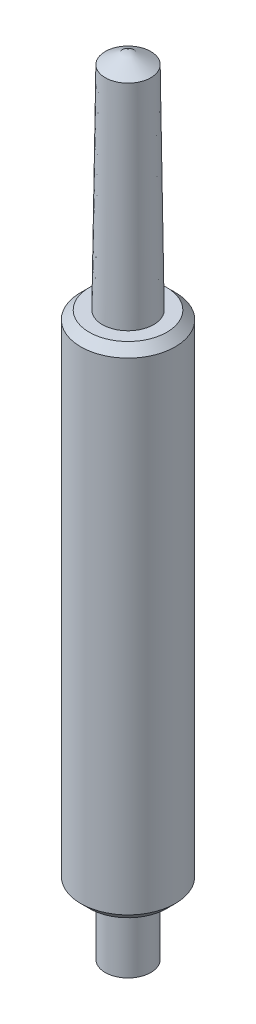
ISO-10303-21;
HEADER;
FILE_DESCRIPTION(('STEP AP214'),'2;1');
FILE_NAME('part.step','',(''),(''),'','','');
FILE_SCHEMA(('AUTOMOTIVE_DESIGN { 1 0 10303 214 1 1 1 1 }'));
ENDSEC;
DATA;
#1=APPLICATION_CONTEXT('core data for automotive mechanical design processes');
#2=APPLICATION_PROTOCOL_DEFINITION('international standard','automotive_design',2000,#1);
#3=PRODUCT_CONTEXT('',#1,'mechanical');
#4=PRODUCT('Part','Part','',(#3));
#5=PRODUCT_RELATED_PRODUCT_CATEGORY('part','',(#4));
#6=PRODUCT_DEFINITION_FORMATION('','',#4);
#7=PRODUCT_DEFINITION_CONTEXT('part definition',#1,'design');
#8=PRODUCT_DEFINITION('design','',#6,#7);
#9=PRODUCT_DEFINITION_SHAPE('','',#8);
#10=(LENGTH_UNIT() NAMED_UNIT(*) SI_UNIT(.MILLI.,.METRE.));
#11=(NAMED_UNIT(*) PLANE_ANGLE_UNIT() SI_UNIT($,.RADIAN.));
#12=(NAMED_UNIT(*) SI_UNIT($,.STERADIAN.) SOLID_ANGLE_UNIT());
#13=UNCERTAINTY_MEASURE_WITH_UNIT(LENGTH_MEASURE(1.E-05),#10,'distance_accuracy_value','');
#14=(GEOMETRIC_REPRESENTATION_CONTEXT(3) GLOBAL_UNCERTAINTY_ASSIGNED_CONTEXT((#13)) GLOBAL_UNIT_ASSIGNED_CONTEXT((#10,
#11,#12)) REPRESENTATION_CONTEXT('',''));
#15=CARTESIAN_POINT('',(0.,0.,0.));
#16=DIRECTION('',(0.,0.,1.));
#17=DIRECTION('',(1.,0.,0.));
#18=AXIS2_PLACEMENT_3D('',#15,#16,#17);
#19=CARTESIAN_POINT('',(-3.89989382420324E-12,-1000.,0.));
#20=DIRECTION('',(0.,-1.,0.));
#21=DIRECTION('',(1.,0.,0.));
#22=AXIS2_PLACEMENT_3D('',#19,#20,#21);
#23=CYLINDRICAL_SURFACE('',#22,0.135000000000407);
#24=CARTESIAN_POINT('',(-4.08156239819756E-13,0.0733916396744583,0.));
#25=DIRECTION('',(0.,-1.,0.));
#26=DIRECTION('',(1.,0.,0.));
#27=AXIS2_PLACEMENT_3D('',#24,#25,#26);
#28=CIRCLE('',#27,0.135000000000408);
#29=CARTESIAN_POINT('',(0.135,0.0733916396744578,0.));
#30=VERTEX_POINT('',#29);
#31=EDGE_CURVE('E11',#30,#30,#28,.T.);
#32=ORIENTED_EDGE('',*,*,#31,.F.);
#33=EDGE_LOOP('',(#32));
#34=FACE_BOUND('',#33,.T.);
#35=CARTESIAN_POINT('',(-4.06841318757627E-13,0.450000000000061,0.));
#36=DIRECTION('',(0.,-1.,0.));
#37=DIRECTION('',(1.,0.,0.));
#38=AXIS2_PLACEMENT_3D('',#35,#36,#37);
#39=CIRCLE('',#38,0.135000000000407);
#40=CARTESIAN_POINT('',(0.135,0.450000000000061,0.));
#41=VERTEX_POINT('',#40);
#42=EDGE_CURVE('E55',#41,#41,#39,.T.);
#43=ORIENTED_EDGE('',*,*,#42,.T.);
#44=EDGE_LOOP('',(#43));
#45=FACE_BOUND('',#44,.T.);
#46=ADVANCED_FACE('F32',(#34,#45),#23,.T.);
#47=CARTESIAN_POINT('',(-4.08156239819756E-13,0.0733916396744583,0.));
#48=DIRECTION('',(0.,1.,0.));
#49=DIRECTION('',(-1.,0.,0.));
#50=AXIS2_PLACEMENT_3D('',#47,#48,#49);
#51=CONICAL_SURFACE('',#50,0.135000000000408,1.07284777274958);
#52=CARTESIAN_POINT('',(-4.08412485360107E-13,0.,0.));
#53=VERTEX_POINT('',#52);
#54=VERTEX_LOOP('',#53);
#55=FACE_BOUND('',#54,.T.);
#56=ORIENTED_EDGE('',*,*,#31,.T.);
#57=EDGE_LOOP('',(#56));
#58=FACE_BOUND('',#57,.T.);
#59=ADVANCED_FACE('F45',(#55,#58),#51,.T.);
#60=CARTESIAN_POINT('',(-3.91827949000599E-13,4.7500000000007,0.));
#61=DIRECTION('',(0.,-1.,0.));
#62=DIRECTION('',(1.,0.,0.));
#63=AXIS2_PLACEMENT_3D('',#60,#61,#62);
#64=CONICAL_SURFACE('',#63,1.96535075528762E-13,1.0358412530179);
#65=CARTESIAN_POINT('',(-3.92107267507701E-13,4.67000000000217,0.));
#66=DIRECTION('',(0.,-1.,0.));
#67=DIRECTION('',(1.,0.,0.));
#68=AXIS2_PLACEMENT_3D('',#65,#66,#67);
#69=CIRCLE('',#68,0.135000000000509);
#70=CARTESIAN_POINT('',(0.135000000000117,4.67000000000217,0.));
#71=VERTEX_POINT('',#70);
#72=EDGE_CURVE('E39',#71,#71,#69,.T.);
#73=ORIENTED_EDGE('',*,*,#72,.F.);
#74=EDGE_LOOP('',(#73));
#75=FACE_BOUND('',#74,.T.);
#76=CARTESIAN_POINT('',(-1.95913974500285E-13,4.75000000000068,0.));
#77=VERTEX_POINT('',#76);
#78=VERTEX_LOOP('',#77);
#79=FACE_BOUND('',#78,.T.);
#80=ADVANCED_FACE('F48',(#75,#79),#64,.T.);
#81=CARTESIAN_POINT('',(-3.92107267507701E-13,4.67000000000217,0.));
#82=DIRECTION('',(0.,-1.,0.));
#83=DIRECTION('',(1.,0.,0.));
#84=AXIS2_PLACEMENT_3D('',#81,#82,#83);
#85=CONICAL_SURFACE('',#84,0.135000000000509,0.0134912448961209);
#86=CARTESIAN_POINT('',(-3.96506533994647E-13,3.41000000000125,0.));
#87=DIRECTION('',(0.,-1.,0.));
#88=DIRECTION('',(1.,0.,0.));
#89=AXIS2_PLACEMENT_3D('',#86,#87,#88);
#90=CIRCLE('',#89,0.151999999993053);
#91=CARTESIAN_POINT('',(0.151999999992656,3.41000000000124,0.));
#92=VERTEX_POINT('',#91);
#93=EDGE_CURVE('E71',#92,#92,#90,.T.);
#94=ORIENTED_EDGE('',*,*,#93,.F.);
#95=EDGE_LOOP('',(#94));
#96=FACE_BOUND('',#95,.T.);
#97=ORIENTED_EDGE('',*,*,#72,.T.);
#98=EDGE_LOOP('',(#97));
#99=FACE_BOUND('',#98,.T.);
#100=ADVANCED_FACE('F76',(#96,#99),#85,.T.);
#101=CARTESIAN_POINT('',(0.151999999992656,3.41000000000059,0.));
#102=DIRECTION('',(0.,-1.,0.));
#103=DIRECTION('',(1.,0.,0.));
#104=AXIS2_PLACEMENT_3D('',#101,#102,#103);
#105=PLANE('',#104);
#106=CARTESIAN_POINT('',(-3.96506533994652E-13,3.40999999999991,0.));
#107=DIRECTION('',(0.,-1.,0.));
#108=DIRECTION('',(1.,0.,0.));
#109=AXIS2_PLACEMENT_3D('',#106,#107,#108);
#110=CIRCLE('',#109,0.230000000000349);
#111=CARTESIAN_POINT('',(0.229999999999952,3.40999999999991,0.));
#112=VERTEX_POINT('',#111);
#113=EDGE_CURVE('E68',#112,#112,#110,.T.);
#114=ORIENTED_EDGE('',*,*,#113,.F.);
#115=EDGE_LOOP('',(#114));
#116=FACE_BOUND('',#115,.T.);
#117=ORIENTED_EDGE('',*,*,#93,.T.);
#118=EDGE_LOOP('',(#117));
#119=FACE_BOUND('',#118,.T.);
#120=ADVANCED_FACE('F83',(#116,#119),#105,.F.);
#121=CARTESIAN_POINT('',(-3.96506533994652E-13,3.40999999999991,0.));
#122=DIRECTION('',(0.,-1.,0.));
#123=DIRECTION('',(1.,0.,0.));
#124=AXIS2_PLACEMENT_3D('',#121,#122,#123);
#125=CONICAL_SURFACE('',#124,0.230000000000349,0.78539816339967);
#126=CARTESIAN_POINT('',(-3.96681108061593E-13,3.36000000000003,0.));
#127=DIRECTION('',(0.,-1.,0.));
#128=DIRECTION('',(1.,0.,0.));
#129=AXIS2_PLACEMENT_3D('',#126,#127,#128);
#130=CIRCLE('',#129,0.280000000000455);
#131=CARTESIAN_POINT('',(0.280000000000058,3.36000000000003,0.));
#132=VERTEX_POINT('',#131);
#133=EDGE_CURVE('E65',#132,#132,#130,.T.);
#134=ORIENTED_EDGE('',*,*,#133,.F.);
#135=EDGE_LOOP('',(#134));
#136=FACE_BOUND('',#135,.T.);
#137=ORIENTED_EDGE('',*,*,#113,.T.);
#138=EDGE_LOOP('',(#137));
#139=FACE_BOUND('',#138,.T.);
#140=ADVANCED_FACE('F89',(#136,#139),#125,.T.);
#141=CARTESIAN_POINT('',(-3.89989382420324E-12,-1000.,0.));
#142=DIRECTION('',(0.,-1.,0.));
#143=DIRECTION('',(1.,0.,0.));
#144=AXIS2_PLACEMENT_3D('',#141,#142,#143);
#145=CYLINDRICAL_SURFACE('',#144,0.280000000000431);
#146=CARTESIAN_POINT('',(-4.06666744690685E-13,0.499999999999945,0.));
#147=DIRECTION('',(0.,-1.,0.));
#148=DIRECTION('',(1.,0.,0.));
#149=AXIS2_PLACEMENT_3D('',#146,#147,#148);
#150=CIRCLE('',#149,0.280000000000407);
#151=CARTESIAN_POINT('',(0.28,0.499999999999944,0.));
#152=VERTEX_POINT('',#151);
#153=EDGE_CURVE('E60',#152,#152,#150,.T.);
#154=ORIENTED_EDGE('',*,*,#153,.F.);
#155=EDGE_LOOP('',(#154));
#156=FACE_BOUND('',#155,.T.);
#157=ORIENTED_EDGE('',*,*,#133,.T.);
#158=EDGE_LOOP('',(#157));
#159=FACE_BOUND('',#158,.T.);
#160=ADVANCED_FACE('F93',(#156,#159),#145,.T.);
#161=CARTESIAN_POINT('',(-4.06666744690685E-13,0.499999999999945,0.));
#162=DIRECTION('',(0.,1.,0.));
#163=DIRECTION('',(-1.,0.,0.));
#164=AXIS2_PLACEMENT_3D('',#161,#162,#163);
#165=CONICAL_SURFACE('',#164,0.280000000000407,0.785398163398612);
#166=CARTESIAN_POINT('',(-4.06841318757627E-13,0.450000000000061,0.));
#167=DIRECTION('',(0.,-1.,0.));
#168=DIRECTION('',(1.,0.,0.));
#169=AXIS2_PLACEMENT_3D('',#166,#167,#168);
#170=CIRCLE('',#169,0.230000000000407);
#171=CARTESIAN_POINT('',(0.23,0.450000000000061,0.));
#172=VERTEX_POINT('',#171);
#173=EDGE_CURVE('E57',#172,#172,#170,.T.);
#174=ORIENTED_EDGE('',*,*,#173,.F.);
#175=EDGE_LOOP('',(#174));
#176=FACE_BOUND('',#175,.T.);
#177=ORIENTED_EDGE('',*,*,#153,.T.);
#178=EDGE_LOOP('',(#177));
#179=FACE_BOUND('',#178,.T.);
#180=ADVANCED_FACE('F97',(#176,#179),#165,.T.);
#181=CARTESIAN_POINT('',(0.23,0.45,0.));
#182=DIRECTION('',(0.,1.,0.));
#183=DIRECTION('',(-1.,0.,0.));
#184=AXIS2_PLACEMENT_3D('',#181,#182,#183);
#185=PLANE('',#184);
#186=ORIENTED_EDGE('',*,*,#42,.F.);
#187=EDGE_LOOP('',(#186));
#188=FACE_BOUND('',#187,.T.);
#189=ORIENTED_EDGE('',*,*,#173,.T.);
#190=EDGE_LOOP('',(#189));
#191=FACE_BOUND('',#190,.T.);
#192=ADVANCED_FACE('F101',(#188,#191),#185,.F.);
#193=CLOSED_SHELL('',(#46,#59,#80,#100,#120,#140,#160,#180,#192));
#194=MANIFOLD_SOLID_BREP('B2',#193);
#195=ADVANCED_BREP_SHAPE_REPRESENTATION('',(#18,#194),#14);
#196=SHAPE_DEFINITION_REPRESENTATION(#9,#195);
ENDSEC;
END-ISO-10303-21;
